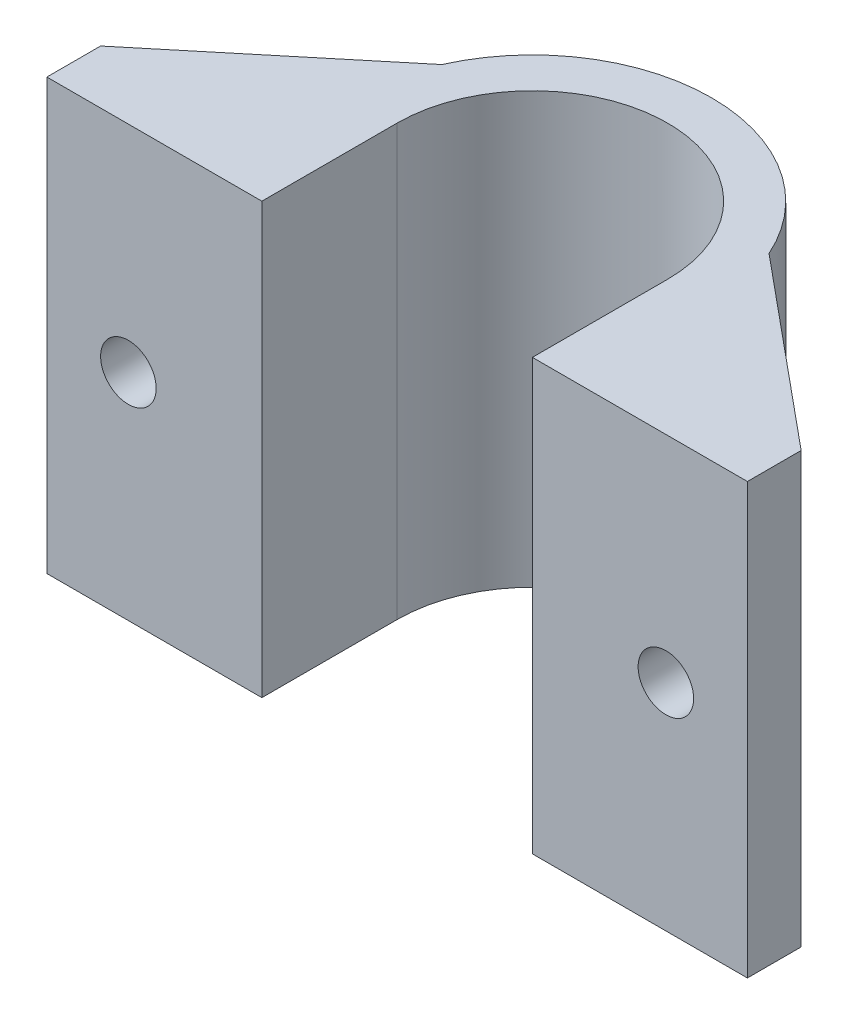
ISO-10303-21;
HEADER;
FILE_DESCRIPTION(('STEP AP214'),'2;1');
FILE_NAME('part.step','',(''),(''),'','','');
FILE_SCHEMA(('AUTOMOTIVE_DESIGN { 1 0 10303 214 1 1 1 1 }'));
ENDSEC;
DATA;
#1=APPLICATION_CONTEXT('core data for automotive mechanical design processes');
#2=APPLICATION_PROTOCOL_DEFINITION('international standard','automotive_design',2000,#1);
#3=PRODUCT_CONTEXT('',#1,'mechanical');
#4=PRODUCT('Part','Part','',(#3));
#5=PRODUCT_RELATED_PRODUCT_CATEGORY('part','',(#4));
#6=PRODUCT_DEFINITION_FORMATION('','',#4);
#7=PRODUCT_DEFINITION_CONTEXT('part definition',#1,'design');
#8=PRODUCT_DEFINITION('design','',#6,#7);
#9=PRODUCT_DEFINITION_SHAPE('','',#8);
#10=(LENGTH_UNIT() NAMED_UNIT(*) SI_UNIT(.MILLI.,.METRE.));
#11=(NAMED_UNIT(*) PLANE_ANGLE_UNIT() SI_UNIT($,.RADIAN.));
#12=(NAMED_UNIT(*) SI_UNIT($,.STERADIAN.) SOLID_ANGLE_UNIT());
#13=UNCERTAINTY_MEASURE_WITH_UNIT(LENGTH_MEASURE(1.E-05),#10,'distance_accuracy_value','');
#14=(GEOMETRIC_REPRESENTATION_CONTEXT(3) GLOBAL_UNCERTAINTY_ASSIGNED_CONTEXT((#13)) GLOBAL_UNIT_ASSIGNED_CONTEXT((#10,
#11,#12)) REPRESENTATION_CONTEXT('',''));
#15=CARTESIAN_POINT('',(0.,0.,0.));
#16=DIRECTION('',(0.,0.,1.));
#17=DIRECTION('',(1.,0.,0.));
#18=AXIS2_PLACEMENT_3D('',#15,#16,#17);
#19=CARTESIAN_POINT('',(19.55,24.,4.55));
#20=DIRECTION('',(-0.637728760622186,0.,0.770261012823115));
#21=DIRECTION('',(0.770261012823115,0.,0.637728760622186));
#22=AXIS2_PLACEMENT_3D('',#19,#20,#21);
#23=PLANE('',#22);
#24=DIRECTION('',(-0.770261012823115,0.,-0.637728760622185));
#25=VECTOR('',#24,1.);
#26=CARTESIAN_POINT('',(19.55,21.,4.55));
#27=LINE('',#26,#25);
#28=CARTESIAN_POINT('',(19.55,21.,4.55));
#29=VERTEX_POINT('',#28);
#30=CARTESIAN_POINT('',(9.13175454080779,21.,-4.07566669471834));
#31=VERTEX_POINT('',#30);
#32=EDGE_CURVE('E328',#29,#31,#27,.T.);
#33=ORIENTED_EDGE('',*,*,#32,.T.);
#34=DIRECTION('',(0.,-1.,0.));
#35=VECTOR('',#34,1.);
#36=CARTESIAN_POINT('',(9.13175454080779,24.,-4.07566669471834));
#37=LINE('',#36,#35);
#38=CARTESIAN_POINT('',(9.13175454080779,24.,-4.07566669471834));
#39=VERTEX_POINT('',#38);
#40=EDGE_CURVE('E184',#39,#31,#37,.T.);
#41=ORIENTED_EDGE('',*,*,#40,.F.);
#42=DIRECTION('',(-0.770261012823115,0.,-0.637728760622185));
#43=VECTOR('',#42,1.);
#44=CARTESIAN_POINT('',(19.55,24.,4.55));
#45=LINE('',#44,#43);
#46=CARTESIAN_POINT('',(19.55,24.,4.55));
#47=VERTEX_POINT('',#46);
#48=EDGE_CURVE('E229',#47,#39,#45,.T.);
#49=ORIENTED_EDGE('',*,*,#48,.F.);
#50=DIRECTION('',(0.,-1.,0.));
#51=VECTOR('',#50,1.);
#52=CARTESIAN_POINT('',(19.55,24.,4.55));
#53=LINE('',#52,#51);
#54=EDGE_CURVE('E183',#47,#29,#53,.T.);
#55=ORIENTED_EDGE('',*,*,#54,.T.);
#56=EDGE_LOOP('',(#33,#41,#49,#55));
#57=FACE_BOUND('',#56,.T.);
#58=ADVANCED_FACE('F34',(#57),#23,.F.);
#59=CARTESIAN_POINT('',(-19.55,24.,4.55));
#60=DIRECTION('',(0.637728760523307,0.,0.770261012904981));
#61=DIRECTION('',(0.770261012904981,0.,-0.637728760523307));
#62=AXIS2_PLACEMENT_3D('',#59,#60,#61);
#63=PLANE('',#62);
#64=DIRECTION('',(-0.770261012904981,0.,0.637728760523307));
#65=VECTOR('',#64,1.);
#66=CARTESIAN_POINT('',(-9.13175454240353,21.,-4.07566669114301));
#67=LINE('',#66,#65);
#68=CARTESIAN_POINT('',(-9.13175454240353,21.,-4.07566669114301));
#69=VERTEX_POINT('',#68);
#70=CARTESIAN_POINT('',(-19.55,21.,4.55));
#71=VERTEX_POINT('',#70);
#72=EDGE_CURVE('E311',#69,#71,#67,.T.);
#73=ORIENTED_EDGE('',*,*,#72,.T.);
#74=DIRECTION('',(0.,-1.,0.));
#75=VECTOR('',#74,1.);
#76=CARTESIAN_POINT('',(-19.55,24.,4.55));
#77=LINE('',#76,#75);
#78=CARTESIAN_POINT('',(-19.55,24.,4.55));
#79=VERTEX_POINT('',#78);
#80=EDGE_CURVE('E271',#79,#71,#77,.T.);
#81=ORIENTED_EDGE('',*,*,#80,.F.);
#82=DIRECTION('',(-0.770261012904981,0.,0.637728760523307));
#83=VECTOR('',#82,1.);
#84=CARTESIAN_POINT('',(-19.55,24.,4.55));
#85=LINE('',#84,#83);
#86=CARTESIAN_POINT('',(-9.13175454240353,24.,-4.07566669114301));
#87=VERTEX_POINT('',#86);
#88=EDGE_CURVE('E233',#87,#79,#85,.T.);
#89=ORIENTED_EDGE('',*,*,#88,.F.);
#90=DIRECTION('',(0.,-1.,0.));
#91=VECTOR('',#90,1.);
#92=CARTESIAN_POINT('',(-9.13175454240353,24.,-4.07566669114301));
#93=LINE('',#92,#91);
#94=EDGE_CURVE('E274',#87,#69,#93,.T.);
#95=ORIENTED_EDGE('',*,*,#94,.T.);
#96=EDGE_LOOP('',(#73,#81,#89,#95));
#97=FACE_BOUND('',#96,.T.);
#98=ADVANCED_FACE('F310',(#97),#63,.F.);
#99=CARTESIAN_POINT('',(0.,24.,0.));
#100=DIRECTION('',(0.,-1.,0.));
#101=DIRECTION('',(0.,0.,-1.));
#102=AXIS2_PLACEMENT_3D('',#99,#100,#101);
#103=CYLINDRICAL_SURFACE('',#102,7.55);
#104=CARTESIAN_POINT('',(0.,0.,0.));
#105=DIRECTION('',(0.,-1.,0.));
#106=DIRECTION('',(0.,0.,1.));
#107=AXIS2_PLACEMENT_3D('',#104,#105,#106);
#108=CIRCLE('',#107,7.55);
#109=CARTESIAN_POINT('',(-7.55,0.,0.));
#110=VERTEX_POINT('',#109);
#111=CARTESIAN_POINT('',(7.55,0.,0.));
#112=VERTEX_POINT('',#111);
#113=EDGE_CURVE('E218',#110,#112,#108,.T.);
#114=ORIENTED_EDGE('',*,*,#113,.T.);
#115=DIRECTION('',(0.,-1.,0.));
#116=VECTOR('',#115,1.);
#117=CARTESIAN_POINT('',(7.55,24.,0.));
#118=LINE('',#117,#116);
#119=CARTESIAN_POINT('',(7.55,24.,0.));
#120=VERTEX_POINT('',#119);
#121=EDGE_CURVE('E11',#120,#112,#118,.T.);
#122=ORIENTED_EDGE('',*,*,#121,.F.);
#123=CARTESIAN_POINT('',(0.,24.,0.));
#124=DIRECTION('',(0.,-1.,0.));
#125=DIRECTION('',(0.,0.,1.));
#126=AXIS2_PLACEMENT_3D('',#123,#124,#125);
#127=CIRCLE('',#126,7.55);
#128=CARTESIAN_POINT('',(-7.55,24.,0.));
#129=VERTEX_POINT('',#128);
#130=EDGE_CURVE('E219',#129,#120,#127,.T.);
#131=ORIENTED_EDGE('',*,*,#130,.F.);
#132=DIRECTION('',(0.,-1.,0.));
#133=VECTOR('',#132,1.);
#134=CARTESIAN_POINT('',(-7.55,24.,0.));
#135=LINE('',#134,#133);
#136=EDGE_CURVE('E241',#129,#110,#135,.T.);
#137=ORIENTED_EDGE('',*,*,#136,.T.);
#138=EDGE_LOOP('',(#114,#122,#131,#137));
#139=FACE_BOUND('',#138,.T.);
#140=ADVANCED_FACE('F36',(#139),#103,.F.);
#141=CARTESIAN_POINT('',(7.55,24.,0.));
#142=DIRECTION('',(1.,0.,0.));
#143=DIRECTION('',(0.,0.,-1.));
#144=AXIS2_PLACEMENT_3D('',#141,#142,#143);
#145=PLANE('',#144);
#146=DIRECTION('',(0.,0.,1.));
#147=VECTOR('',#146,1.);
#148=CARTESIAN_POINT('',(7.55,0.,0.));
#149=LINE('',#148,#147);
#150=CARTESIAN_POINT('',(7.55,0.,7.55));
#151=VERTEX_POINT('',#150);
#152=EDGE_CURVE('E244',#112,#151,#149,.T.);
#153=ORIENTED_EDGE('',*,*,#152,.T.);
#154=DIRECTION('',(0.,-1.,0.));
#155=VECTOR('',#154,1.);
#156=CARTESIAN_POINT('',(7.55,24.,7.55));
#157=LINE('',#156,#155);
#158=CARTESIAN_POINT('',(7.55,24.,7.55));
#159=VERTEX_POINT('',#158);
#160=EDGE_CURVE('E43',#159,#151,#157,.T.);
#161=ORIENTED_EDGE('',*,*,#160,.F.);
#162=DIRECTION('',(0.,0.,1.));
#163=VECTOR('',#162,1.);
#164=CARTESIAN_POINT('',(7.55,24.,0.));
#165=LINE('',#164,#163);
#166=EDGE_CURVE('E222',#120,#159,#165,.T.);
#167=ORIENTED_EDGE('',*,*,#166,.F.);
#168=ORIENTED_EDGE('',*,*,#121,.T.);
#169=EDGE_LOOP('',(#153,#161,#167,#168));
#170=FACE_BOUND('',#169,.T.);
#171=ADVANCED_FACE('F346',(#170),#145,.F.);
#172=CARTESIAN_POINT('',(7.55,24.,7.55));
#173=DIRECTION('',(0.,0.,-1.));
#174=DIRECTION('',(-1.,0.,0.));
#175=AXIS2_PLACEMENT_3D('',#172,#173,#174);
#176=PLANE('',#175);
#177=CARTESIAN_POINT('',(15.,12.,7.55));
#178=DIRECTION('',(0.,0.,1.));
#179=DIRECTION('',(1.,0.,0.));
#180=AXIS2_PLACEMENT_3D('',#177,#178,#179);
#181=CIRCLE('',#180,1.55);
#182=CARTESIAN_POINT('',(16.55,12.,7.55));
#183=VERTEX_POINT('',#182);
#184=EDGE_CURVE('E200',#183,#183,#181,.T.);
#185=ORIENTED_EDGE('',*,*,#184,.F.);
#186=EDGE_LOOP('',(#185));
#187=FACE_BOUND('',#186,.T.);
#188=DIRECTION('',(1.,0.,0.));
#189=VECTOR('',#188,1.);
#190=CARTESIAN_POINT('',(7.55,0.,7.55));
#191=LINE('',#190,#189);
#192=CARTESIAN_POINT('',(19.55,0.,7.55));
#193=VERTEX_POINT('',#192);
#194=EDGE_CURVE('E246',#151,#193,#191,.T.);
#195=ORIENTED_EDGE('',*,*,#194,.T.);
#196=DIRECTION('',(0.,-1.,0.));
#197=VECTOR('',#196,1.);
#198=CARTESIAN_POINT('',(19.55,24.,7.55));
#199=LINE('',#198,#197);
#200=CARTESIAN_POINT('',(19.55,24.,7.55));
#201=VERTEX_POINT('',#200);
#202=EDGE_CURVE('E186',#201,#193,#199,.T.);
#203=ORIENTED_EDGE('',*,*,#202,.F.);
#204=DIRECTION('',(1.,0.,0.));
#205=VECTOR('',#204,1.);
#206=CARTESIAN_POINT('',(7.55,24.,7.55));
#207=LINE('',#206,#205);
#208=EDGE_CURVE('E225',#159,#201,#207,.T.);
#209=ORIENTED_EDGE('',*,*,#208,.F.);
#210=ORIENTED_EDGE('',*,*,#160,.T.);
#211=EDGE_LOOP('',(#195,#203,#209,#210));
#212=FACE_BOUND('',#211,.T.);
#213=ADVANCED_FACE('F343',(#187,#212),#176,.F.);
#214=CARTESIAN_POINT('',(19.55,24.,7.55));
#215=DIRECTION('',(-1.,0.,0.));
#216=DIRECTION('',(0.,0.,1.));
#217=AXIS2_PLACEMENT_3D('',#214,#215,#216);
#218=PLANE('',#217);
#219=DIRECTION('',(0.,0.,-1.));
#220=VECTOR('',#219,1.);
#221=CARTESIAN_POINT('',(19.55,0.,7.55));
#222=LINE('',#221,#220);
#223=CARTESIAN_POINT('',(19.55,0.,4.55));
#224=VERTEX_POINT('',#223);
#225=EDGE_CURVE('E181',#193,#224,#222,.T.);
#226=ORIENTED_EDGE('',*,*,#225,.T.);
#227=CARTESIAN_POINT('',(19.55,4.,4.55));
#228=VERTEX_POINT('',#227);
#229=EDGE_CURVE('E173',#228,#224,#53,.T.);
#230=ORIENTED_EDGE('',*,*,#229,.F.);
#231=DIRECTION('',(0.,1.,0.));
#232=VECTOR('',#231,1.);
#233=CARTESIAN_POINT('',(19.55,4.,4.55));
#234=LINE('',#233,#232);
#235=EDGE_CURVE('E150',#228,#29,#234,.T.);
#236=ORIENTED_EDGE('',*,*,#235,.T.);
#237=ORIENTED_EDGE('',*,*,#54,.F.);
#238=DIRECTION('',(0.,0.,-1.));
#239=VECTOR('',#238,1.);
#240=CARTESIAN_POINT('',(19.55,24.,7.55));
#241=LINE('',#240,#239);
#242=EDGE_CURVE('E227',#201,#47,#241,.T.);
#243=ORIENTED_EDGE('',*,*,#242,.F.);
#244=ORIENTED_EDGE('',*,*,#202,.T.);
#245=EDGE_LOOP('',(#226,#230,#236,#237,#243,#244));
#246=FACE_BOUND('',#245,.T.);
#247=ADVANCED_FACE('F178',(#246),#218,.F.);
#248=CARTESIAN_POINT('',(9.13175454080779,4.,-4.07566669471834));
#249=VERTEX_POINT('',#248);
#250=CARTESIAN_POINT('',(9.13175454080779,0.,-4.07566669471834));
#251=VERTEX_POINT('',#250);
#252=EDGE_CURVE('E175',#249,#251,#37,.T.);
#253=ORIENTED_EDGE('',*,*,#252,.F.);
#254=DIRECTION('',(-0.770261012823115,0.,-0.637728760622185));
#255=VECTOR('',#254,1.);
#256=CARTESIAN_POINT('',(19.55,4.,4.55));
#257=LINE('',#256,#255);
#258=EDGE_CURVE('E166',#228,#249,#257,.T.);
#259=ORIENTED_EDGE('',*,*,#258,.F.);
#260=ORIENTED_EDGE('',*,*,#229,.T.);
#261=DIRECTION('',(-0.770261012823115,0.,-0.637728760622185));
#262=VECTOR('',#261,1.);
#263=CARTESIAN_POINT('',(19.55,0.,4.55));
#264=LINE('',#263,#262);
#265=EDGE_CURVE('E249',#224,#251,#264,.T.);
#266=ORIENTED_EDGE('',*,*,#265,.T.);
#267=EDGE_LOOP('',(#253,#259,#260,#266));
#268=FACE_BOUND('',#267,.T.);
#269=ADVANCED_FACE('F171',(#268),#23,.F.);
#270=CARTESIAN_POINT('',(0.,24.,0.));
#271=DIRECTION('',(0.,-1.,0.));
#272=DIRECTION('',(0.,0.,-1.));
#273=AXIS2_PLACEMENT_3D('',#270,#271,#272);
#274=CYLINDRICAL_SURFACE('',#273,10.);
#275=CARTESIAN_POINT('',(0.,0.,0.));
#276=DIRECTION('',(0.,1.,0.));
#277=DIRECTION('',(0.,0.,1.));
#278=AXIS2_PLACEMENT_3D('',#275,#276,#277);
#279=CIRCLE('',#278,10.);
#280=CARTESIAN_POINT('',(-9.13175454240353,0.,-4.07566669114301));
#281=VERTEX_POINT('',#280);
#282=EDGE_CURVE('E251',#251,#281,#279,.T.);
#283=ORIENTED_EDGE('',*,*,#282,.T.);
#284=CARTESIAN_POINT('',(-9.13175454240353,4.,-4.07566669114301));
#285=VERTEX_POINT('',#284);
#286=EDGE_CURVE('E273',#285,#281,#93,.T.);
#287=ORIENTED_EDGE('',*,*,#286,.F.);
#288=DIRECTION('',(0.,1.,0.));
#289=VECTOR('',#288,1.);
#290=CARTESIAN_POINT('',(-9.13175454240353,4.,-4.07566669114301));
#291=LINE('',#290,#289);
#292=EDGE_CURVE('E208',#285,#69,#291,.T.);
#293=ORIENTED_EDGE('',*,*,#292,.T.);
#294=ORIENTED_EDGE('',*,*,#94,.F.);
#295=CARTESIAN_POINT('',(0.,24.,0.));
#296=DIRECTION('',(0.,1.,0.));
#297=DIRECTION('',(0.,0.,1.));
#298=AXIS2_PLACEMENT_3D('',#295,#296,#297);
#299=CIRCLE('',#298,10.);
#300=EDGE_CURVE('E231',#39,#87,#299,.T.);
#301=ORIENTED_EDGE('',*,*,#300,.F.);
#302=ORIENTED_EDGE('',*,*,#40,.T.);
#303=DIRECTION('',(0.,1.,0.));
#304=VECTOR('',#303,1.);
#305=CARTESIAN_POINT('',(9.13175454080779,4.,-4.07566669471834));
#306=LINE('',#305,#304);
#307=EDGE_CURVE('E161',#249,#31,#306,.T.);
#308=ORIENTED_EDGE('',*,*,#307,.F.);
#309=ORIENTED_EDGE('',*,*,#252,.T.);
#310=EDGE_LOOP('',(#283,#287,#293,#294,#301,#302,#308,#309));
#311=FACE_BOUND('',#310,.T.);
#312=ADVANCED_FACE('F290',(#311),#274,.T.);
#313=CARTESIAN_POINT('',(-19.55,4.,4.55));
#314=VERTEX_POINT('',#313);
#315=CARTESIAN_POINT('',(-19.55,0.,4.55));
#316=VERTEX_POINT('',#315);
#317=EDGE_CURVE('E270',#314,#316,#77,.T.);
#318=ORIENTED_EDGE('',*,*,#317,.F.);
#319=DIRECTION('',(-0.770261012904981,0.,0.637728760523307));
#320=VECTOR('',#319,1.);
#321=CARTESIAN_POINT('',(-9.13175454240353,4.,-4.07566669114301));
#322=LINE('',#321,#320);
#323=EDGE_CURVE('E287',#285,#314,#322,.T.);
#324=ORIENTED_EDGE('',*,*,#323,.F.);
#325=ORIENTED_EDGE('',*,*,#286,.T.);
#326=DIRECTION('',(-0.770261012904981,0.,0.637728760523307));
#327=VECTOR('',#326,1.);
#328=CARTESIAN_POINT('',(-19.55,0.,4.55));
#329=LINE('',#328,#327);
#330=EDGE_CURVE('E254',#281,#316,#329,.T.);
#331=ORIENTED_EDGE('',*,*,#330,.T.);
#332=EDGE_LOOP('',(#318,#324,#325,#331));
#333=FACE_BOUND('',#332,.T.);
#334=ADVANCED_FACE('F284',(#333),#63,.F.);
#335=CARTESIAN_POINT('',(-19.55,24.,7.55));
#336=DIRECTION('',(1.,0.,0.));
#337=DIRECTION('',(0.,0.,-1.));
#338=AXIS2_PLACEMENT_3D('',#335,#336,#337);
#339=PLANE('',#338);
#340=DIRECTION('',(0.,0.,1.));
#341=VECTOR('',#340,1.);
#342=CARTESIAN_POINT('',(-19.55,0.,7.55));
#343=LINE('',#342,#341);
#344=CARTESIAN_POINT('',(-19.55,0.,7.55));
#345=VERTEX_POINT('',#344);
#346=EDGE_CURVE('E257',#316,#345,#343,.T.);
#347=ORIENTED_EDGE('',*,*,#346,.T.);
#348=DIRECTION('',(0.,-1.,0.));
#349=VECTOR('',#348,1.);
#350=CARTESIAN_POINT('',(-19.55,24.,7.55));
#351=LINE('',#350,#349);
#352=CARTESIAN_POINT('',(-19.55,24.,7.55));
#353=VERTEX_POINT('',#352);
#354=EDGE_CURVE('E267',#353,#345,#351,.T.);
#355=ORIENTED_EDGE('',*,*,#354,.F.);
#356=DIRECTION('',(0.,0.,1.));
#357=VECTOR('',#356,1.);
#358=CARTESIAN_POINT('',(-19.55,24.,7.55));
#359=LINE('',#358,#357);
#360=EDGE_CURVE('E235',#79,#353,#359,.T.);
#361=ORIENTED_EDGE('',*,*,#360,.F.);
#362=ORIENTED_EDGE('',*,*,#80,.T.);
#363=DIRECTION('',(0.,1.,0.));
#364=VECTOR('',#363,1.);
#365=CARTESIAN_POINT('',(-19.55,4.,4.55));
#366=LINE('',#365,#364);
#367=EDGE_CURVE('E202',#314,#71,#366,.T.);
#368=ORIENTED_EDGE('',*,*,#367,.F.);
#369=ORIENTED_EDGE('',*,*,#317,.T.);
#370=EDGE_LOOP('',(#347,#355,#361,#362,#368,#369));
#371=FACE_BOUND('',#370,.T.);
#372=ADVANCED_FACE('F298',(#371),#339,.F.);
#373=CARTESIAN_POINT('',(-7.55,24.,7.55));
#374=DIRECTION('',(0.,0.,-1.));
#375=DIRECTION('',(-1.,0.,0.));
#376=AXIS2_PLACEMENT_3D('',#373,#374,#375);
#377=PLANE('',#376);
#378=CARTESIAN_POINT('',(-15.,12.,7.55));
#379=DIRECTION('',(0.,0.,1.));
#380=DIRECTION('',(1.,0.,0.));
#381=AXIS2_PLACEMENT_3D('',#378,#379,#380);
#382=CIRCLE('',#381,1.55);
#383=CARTESIAN_POINT('',(-13.45,12.,7.55));
#384=VERTEX_POINT('',#383);
#385=EDGE_CURVE('E195',#384,#384,#382,.T.);
#386=ORIENTED_EDGE('',*,*,#385,.F.);
#387=EDGE_LOOP('',(#386));
#388=FACE_BOUND('',#387,.T.);
#389=DIRECTION('',(1.,0.,0.));
#390=VECTOR('',#389,1.);
#391=CARTESIAN_POINT('',(-7.55,0.,7.55));
#392=LINE('',#391,#390);
#393=CARTESIAN_POINT('',(-7.55,0.,7.55));
#394=VERTEX_POINT('',#393);
#395=EDGE_CURVE('E259',#345,#394,#392,.T.);
#396=ORIENTED_EDGE('',*,*,#395,.T.);
#397=DIRECTION('',(0.,-1.,0.));
#398=VECTOR('',#397,1.);
#399=CARTESIAN_POINT('',(-7.55,24.,7.55));
#400=LINE('',#399,#398);
#401=CARTESIAN_POINT('',(-7.55,24.,7.55));
#402=VERTEX_POINT('',#401);
#403=EDGE_CURVE('E264',#402,#394,#400,.T.);
#404=ORIENTED_EDGE('',*,*,#403,.F.);
#405=DIRECTION('',(1.,0.,0.));
#406=VECTOR('',#405,1.);
#407=CARTESIAN_POINT('',(-7.55,24.,7.55));
#408=LINE('',#407,#406);
#409=EDGE_CURVE('E237',#353,#402,#408,.T.);
#410=ORIENTED_EDGE('',*,*,#409,.F.);
#411=ORIENTED_EDGE('',*,*,#354,.T.);
#412=EDGE_LOOP('',(#396,#404,#410,#411));
#413=FACE_BOUND('',#412,.T.);
#414=ADVANCED_FACE('F303',(#388,#413),#377,.F.);
#415=CARTESIAN_POINT('',(-7.55,24.,0.));
#416=DIRECTION('',(-1.,0.,0.));
#417=DIRECTION('',(0.,0.,1.));
#418=AXIS2_PLACEMENT_3D('',#415,#416,#417);
#419=PLANE('',#418);
#420=DIRECTION('',(0.,0.,-1.));
#421=VECTOR('',#420,1.);
#422=CARTESIAN_POINT('',(-7.55,0.,0.));
#423=LINE('',#422,#421);
#424=EDGE_CURVE('E223',#394,#110,#423,.T.);
#425=ORIENTED_EDGE('',*,*,#424,.T.);
#426=ORIENTED_EDGE('',*,*,#136,.F.);
#427=DIRECTION('',(0.,0.,-1.));
#428=VECTOR('',#427,1.);
#429=CARTESIAN_POINT('',(-7.55,24.,0.));
#430=LINE('',#429,#428);
#431=EDGE_CURVE('E239',#402,#129,#430,.T.);
#432=ORIENTED_EDGE('',*,*,#431,.F.);
#433=ORIENTED_EDGE('',*,*,#403,.T.);
#434=EDGE_LOOP('',(#425,#426,#432,#433));
#435=FACE_BOUND('',#434,.T.);
#436=ADVANCED_FACE('F351',(#435),#419,.F.);
#437=CARTESIAN_POINT('',(0.,24.,0.));
#438=DIRECTION('',(0.,1.,0.));
#439=DIRECTION('',(0.,0.,1.));
#440=AXIS2_PLACEMENT_3D('',#437,#438,#439);
#441=PLANE('',#440);
#442=ORIENTED_EDGE('',*,*,#130,.T.);
#443=ORIENTED_EDGE('',*,*,#166,.T.);
#444=ORIENTED_EDGE('',*,*,#208,.T.);
#445=ORIENTED_EDGE('',*,*,#242,.T.);
#446=ORIENTED_EDGE('',*,*,#48,.T.);
#447=ORIENTED_EDGE('',*,*,#300,.T.);
#448=ORIENTED_EDGE('',*,*,#88,.T.);
#449=ORIENTED_EDGE('',*,*,#360,.T.);
#450=ORIENTED_EDGE('',*,*,#409,.T.);
#451=ORIENTED_EDGE('',*,*,#431,.T.);
#452=EDGE_LOOP('',(#442,#443,#444,#445,#446,#447,#448,#449,#450,#451));
#453=FACE_BOUND('',#452,.T.);
#454=ADVANCED_FACE('F307',(#453),#441,.T.);
#455=CARTESIAN_POINT('',(0.,0.,0.));
#456=DIRECTION('',(0.,1.,0.));
#457=DIRECTION('',(0.,0.,1.));
#458=AXIS2_PLACEMENT_3D('',#455,#456,#457);
#459=PLANE('',#458);
#460=ORIENTED_EDGE('',*,*,#113,.F.);
#461=ORIENTED_EDGE('',*,*,#424,.F.);
#462=ORIENTED_EDGE('',*,*,#395,.F.);
#463=ORIENTED_EDGE('',*,*,#346,.F.);
#464=ORIENTED_EDGE('',*,*,#330,.F.);
#465=ORIENTED_EDGE('',*,*,#282,.F.);
#466=ORIENTED_EDGE('',*,*,#265,.F.);
#467=ORIENTED_EDGE('',*,*,#225,.F.);
#468=ORIENTED_EDGE('',*,*,#194,.F.);
#469=ORIENTED_EDGE('',*,*,#152,.F.);
#470=EDGE_LOOP('',(#460,#461,#462,#463,#464,#465,#466,#467,#468,#469));
#471=FACE_BOUND('',#470,.T.);
#472=ADVANCED_FACE('F293',(#471),#459,.F.);
#473=CARTESIAN_POINT('',(15.,12.,-10.));
#474=DIRECTION('',(0.,0.,1.));
#475=DIRECTION('',(1.,0.,0.));
#476=AXIS2_PLACEMENT_3D('',#473,#474,#475);
#477=CYLINDRICAL_SURFACE('',#476,1.55);
#478=CARTESIAN_POINT('',(15.,12.,4.55));
#479=DIRECTION('',(0.,0.,1.));
#480=DIRECTION('',(1.,0.,0.));
#481=AXIS2_PLACEMENT_3D('',#478,#479,#480);
#482=CIRCLE('',#481,1.55);
#483=CARTESIAN_POINT('',(16.55,12.,4.55));
#484=VERTEX_POINT('',#483);
#485=EDGE_CURVE('E38',#484,#484,#482,.F.);
#486=ORIENTED_EDGE('',*,*,#485,.T.);
#487=EDGE_LOOP('',(#486));
#488=FACE_BOUND('',#487,.T.);
#489=ORIENTED_EDGE('',*,*,#184,.T.);
#490=EDGE_LOOP('',(#489));
#491=FACE_BOUND('',#490,.T.);
#492=ADVANCED_FACE('F422',(#488,#491),#477,.F.);
#493=CARTESIAN_POINT('',(-15.,12.,-10.));
#494=DIRECTION('',(0.,0.,1.));
#495=DIRECTION('',(1.,0.,0.));
#496=AXIS2_PLACEMENT_3D('',#493,#494,#495);
#497=CYLINDRICAL_SURFACE('',#496,1.55);
#498=CARTESIAN_POINT('',(-15.,12.,4.55));
#499=DIRECTION('',(0.,0.,1.));
#500=DIRECTION('',(1.,0.,0.));
#501=AXIS2_PLACEMENT_3D('',#498,#499,#500);
#502=CIRCLE('',#501,1.55);
#503=CARTESIAN_POINT('',(-13.45,12.,4.55));
#504=VERTEX_POINT('',#503);
#505=EDGE_CURVE('E193',#504,#504,#502,.F.);
#506=ORIENTED_EDGE('',*,*,#505,.T.);
#507=EDGE_LOOP('',(#506));
#508=FACE_BOUND('',#507,.T.);
#509=ORIENTED_EDGE('',*,*,#385,.T.);
#510=EDGE_LOOP('',(#509));
#511=FACE_BOUND('',#510,.T.);
#512=ADVANCED_FACE('F417',(#508,#511),#497,.F.);
#513=CARTESIAN_POINT('',(-19.55,4.,4.55));
#514=DIRECTION('',(0.,0.,1.));
#515=DIRECTION('',(1.,0.,0.));
#516=AXIS2_PLACEMENT_3D('',#513,#514,#515);
#517=PLANE('',#516);
#518=DIRECTION('',(1.,0.,0.));
#519=VECTOR('',#518,1.);
#520=CARTESIAN_POINT('',(-19.55,21.,4.55));
#521=LINE('',#520,#519);
#522=CARTESIAN_POINT('',(-9.13175454240353,21.,4.55));
#523=VERTEX_POINT('',#522);
#524=EDGE_CURVE('E211',#71,#523,#521,.T.);
#525=ORIENTED_EDGE('',*,*,#524,.T.);
#526=DIRECTION('',(0.,1.,0.));
#527=VECTOR('',#526,1.);
#528=CARTESIAN_POINT('',(-9.13175454240353,4.,4.55));
#529=LINE('',#528,#527);
#530=CARTESIAN_POINT('',(-9.13175454240353,4.,4.55));
#531=VERTEX_POINT('',#530);
#532=EDGE_CURVE('E196',#531,#523,#529,.T.);
#533=ORIENTED_EDGE('',*,*,#532,.F.);
#534=DIRECTION('',(1.,0.,0.));
#535=VECTOR('',#534,1.);
#536=CARTESIAN_POINT('',(-19.55,4.,4.55));
#537=LINE('',#536,#535);
#538=EDGE_CURVE('E59',#314,#531,#537,.T.);
#539=ORIENTED_EDGE('',*,*,#538,.F.);
#540=ORIENTED_EDGE('',*,*,#367,.T.);
#541=EDGE_LOOP('',(#525,#533,#539,#540));
#542=FACE_BOUND('',#541,.T.);
#543=ORIENTED_EDGE('',*,*,#505,.F.);
#544=EDGE_LOOP('',(#543));
#545=FACE_BOUND('',#544,.T.);
#546=ADVANCED_FACE('F421',(#542,#545),#517,.F.);
#547=CARTESIAN_POINT('',(-9.13175454240353,4.,4.55));
#548=DIRECTION('',(1.,0.,0.));
#549=DIRECTION('',(0.,0.,-1.));
#550=AXIS2_PLACEMENT_3D('',#547,#548,#549);
#551=PLANE('',#550);
#552=DIRECTION('',(0.,0.,-1.));
#553=VECTOR('',#552,1.);
#554=CARTESIAN_POINT('',(-9.13175454240353,21.,4.55));
#555=LINE('',#554,#553);
#556=EDGE_CURVE('E314',#523,#69,#555,.T.);
#557=ORIENTED_EDGE('',*,*,#556,.T.);
#558=ORIENTED_EDGE('',*,*,#292,.F.);
#559=DIRECTION('',(0.,0.,-1.));
#560=VECTOR('',#559,1.);
#561=CARTESIAN_POINT('',(-9.13175454240353,4.,4.55));
#562=LINE('',#561,#560);
#563=EDGE_CURVE('E316',#531,#285,#562,.T.);
#564=ORIENTED_EDGE('',*,*,#563,.F.);
#565=ORIENTED_EDGE('',*,*,#532,.T.);
#566=EDGE_LOOP('',(#557,#558,#564,#565));
#567=FACE_BOUND('',#566,.T.);
#568=ADVANCED_FACE('F432',(#567),#551,.F.);
#569=CARTESIAN_POINT('',(0.,4.,0.));
#570=DIRECTION('',(0.,-1.,0.));
#571=DIRECTION('',(0.,0.,-1.));
#572=AXIS2_PLACEMENT_3D('',#569,#570,#571);
#573=PLANE('',#572);
#574=ORIENTED_EDGE('',*,*,#563,.T.);
#575=ORIENTED_EDGE('',*,*,#323,.T.);
#576=ORIENTED_EDGE('',*,*,#538,.T.);
#577=EDGE_LOOP('',(#574,#575,#576));
#578=FACE_BOUND('',#577,.T.);
#579=ADVANCED_FACE('F441',(#578),#573,.F.);
#580=CARTESIAN_POINT('',(0.,21.,0.));
#581=DIRECTION('',(0.,-1.,0.));
#582=DIRECTION('',(0.,0.,-1.));
#583=AXIS2_PLACEMENT_3D('',#580,#581,#582);
#584=PLANE('',#583);
#585=ORIENTED_EDGE('',*,*,#556,.F.);
#586=ORIENTED_EDGE('',*,*,#524,.F.);
#587=ORIENTED_EDGE('',*,*,#72,.F.);
#588=EDGE_LOOP('',(#585,#586,#587));
#589=FACE_BOUND('',#588,.T.);
#590=ADVANCED_FACE('F450',(#589),#584,.T.);
#591=CARTESIAN_POINT('',(9.13175454080779,4.,4.55));
#592=DIRECTION('',(0.,0.,1.));
#593=DIRECTION('',(1.,0.,0.));
#594=AXIS2_PLACEMENT_3D('',#591,#592,#593);
#595=PLANE('',#594);
#596=DIRECTION('',(1.,0.,0.));
#597=VECTOR('',#596,1.);
#598=CARTESIAN_POINT('',(9.13175454080779,21.,4.55));
#599=LINE('',#598,#597);
#600=CARTESIAN_POINT('',(9.13175454080779,21.,4.55));
#601=VERTEX_POINT('',#600);
#602=EDGE_CURVE('E156',#601,#29,#599,.T.);
#603=ORIENTED_EDGE('',*,*,#602,.T.);
#604=ORIENTED_EDGE('',*,*,#235,.F.);
#605=DIRECTION('',(1.,0.,0.));
#606=VECTOR('',#605,1.);
#607=CARTESIAN_POINT('',(9.13175454080779,4.,4.55));
#608=LINE('',#607,#606);
#609=CARTESIAN_POINT('',(9.13175454080779,4.,4.55));
#610=VERTEX_POINT('',#609);
#611=EDGE_CURVE('E154',#610,#228,#608,.T.);
#612=ORIENTED_EDGE('',*,*,#611,.F.);
#613=DIRECTION('',(0.,1.,0.));
#614=VECTOR('',#613,1.);
#615=CARTESIAN_POINT('',(9.13175454080779,4.,4.55));
#616=LINE('',#615,#614);
#617=EDGE_CURVE('E324',#610,#601,#616,.T.);
#618=ORIENTED_EDGE('',*,*,#617,.T.);
#619=EDGE_LOOP('',(#603,#604,#612,#618));
#620=FACE_BOUND('',#619,.T.);
#621=ORIENTED_EDGE('',*,*,#485,.F.);
#622=EDGE_LOOP('',(#621));
#623=FACE_BOUND('',#622,.T.);
#624=ADVANCED_FACE('F152',(#620,#623),#595,.F.);
#625=CARTESIAN_POINT('',(9.13175454080779,4.,-4.07566669471834));
#626=DIRECTION('',(-1.,0.,0.));
#627=DIRECTION('',(0.,0.,1.));
#628=AXIS2_PLACEMENT_3D('',#625,#626,#627);
#629=PLANE('',#628);
#630=DIRECTION('',(0.,0.,1.));
#631=VECTOR('',#630,1.);
#632=CARTESIAN_POINT('',(9.13175454080779,21.,-4.07566669471834));
#633=LINE('',#632,#631);
#634=EDGE_CURVE('E168',#31,#601,#633,.T.);
#635=ORIENTED_EDGE('',*,*,#634,.T.);
#636=ORIENTED_EDGE('',*,*,#617,.F.);
#637=DIRECTION('',(0.,0.,1.));
#638=VECTOR('',#637,1.);
#639=CARTESIAN_POINT('',(9.13175454080779,4.,-4.07566669471834));
#640=LINE('',#639,#638);
#641=EDGE_CURVE('E51',#249,#610,#640,.T.);
#642=ORIENTED_EDGE('',*,*,#641,.F.);
#643=ORIENTED_EDGE('',*,*,#307,.T.);
#644=EDGE_LOOP('',(#635,#636,#642,#643));
#645=FACE_BOUND('',#644,.T.);
#646=ADVANCED_FACE('F495',(#645),#629,.F.);
#647=CARTESIAN_POINT('',(0.,4.,0.));
#648=DIRECTION('',(0.,-1.,0.));
#649=DIRECTION('',(0.,0.,-1.));
#650=AXIS2_PLACEMENT_3D('',#647,#648,#649);
#651=PLANE('',#650);
#652=ORIENTED_EDGE('',*,*,#611,.T.);
#653=ORIENTED_EDGE('',*,*,#258,.T.);
#654=ORIENTED_EDGE('',*,*,#641,.T.);
#655=EDGE_LOOP('',(#652,#653,#654));
#656=FACE_BOUND('',#655,.T.);
#657=ADVANCED_FACE('F165',(#656),#651,.F.);
#658=CARTESIAN_POINT('',(0.,21.,0.));
#659=DIRECTION('',(0.,-1.,0.));
#660=DIRECTION('',(0.,0.,-1.));
#661=AXIS2_PLACEMENT_3D('',#658,#659,#660);
#662=PLANE('',#661);
#663=ORIENTED_EDGE('',*,*,#602,.F.);
#664=ORIENTED_EDGE('',*,*,#634,.F.);
#665=ORIENTED_EDGE('',*,*,#32,.F.);
#666=EDGE_LOOP('',(#663,#664,#665));
#667=FACE_BOUND('',#666,.T.);
#668=ADVANCED_FACE('F512',(#667),#662,.T.);
#669=CLOSED_SHELL('',(#58,#98,#140,#171,#213,#247,#269,#312,#334,#372,#414,#436,#454,#472,#492,
#512,#546,#568,#579,#590,#624,#646,#657,#668));
#670=MANIFOLD_SOLID_BREP('B2',#669);
#671=ADVANCED_BREP_SHAPE_REPRESENTATION('',(#18,#670),#14);
#672=SHAPE_DEFINITION_REPRESENTATION(#9,#671);
ENDSEC;
END-ISO-10303-21;
